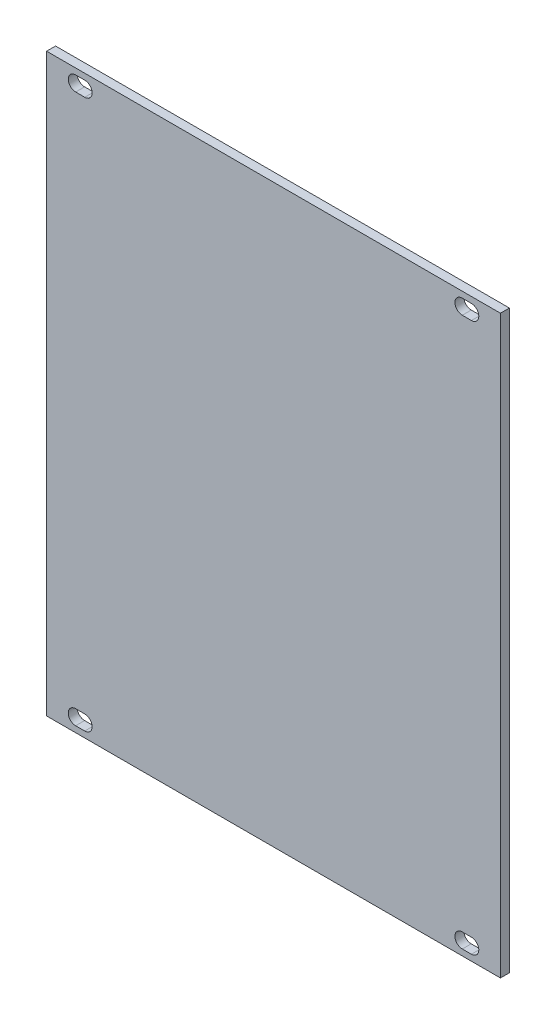
ISO-10303-21;
HEADER;
FILE_DESCRIPTION(('STEP AP214'),'2;1');
FILE_NAME('part.step','',(''),(''),'','','');
FILE_SCHEMA(('AUTOMOTIVE_DESIGN { 1 0 10303 214 1 1 1 1 }'));
ENDSEC;
DATA;
#1=APPLICATION_CONTEXT('core data for automotive mechanical design processes');
#2=APPLICATION_PROTOCOL_DEFINITION('international standard','automotive_design',2000,#1);
#3=PRODUCT_CONTEXT('',#1,'mechanical');
#4=PRODUCT('Part','Part','',(#3));
#5=PRODUCT_RELATED_PRODUCT_CATEGORY('part','',(#4));
#6=PRODUCT_DEFINITION_FORMATION('','',#4);
#7=PRODUCT_DEFINITION_CONTEXT('part definition',#1,'design');
#8=PRODUCT_DEFINITION('design','',#6,#7);
#9=PRODUCT_DEFINITION_SHAPE('','',#8);
#10=(LENGTH_UNIT() NAMED_UNIT(*) SI_UNIT(.MILLI.,.METRE.));
#11=(NAMED_UNIT(*) PLANE_ANGLE_UNIT() SI_UNIT($,.RADIAN.));
#12=(NAMED_UNIT(*) SI_UNIT($,.STERADIAN.) SOLID_ANGLE_UNIT());
#13=UNCERTAINTY_MEASURE_WITH_UNIT(LENGTH_MEASURE(1.E-05),#10,'distance_accuracy_value','');
#14=(GEOMETRIC_REPRESENTATION_CONTEXT(3) GLOBAL_UNCERTAINTY_ASSIGNED_CONTEXT((#13)) GLOBAL_UNIT_ASSIGNED_CONTEXT((#10,
#11,#12)) REPRESENTATION_CONTEXT('',''));
#15=CARTESIAN_POINT('',(0.,0.,0.));
#16=DIRECTION('',(0.,0.,1.));
#17=DIRECTION('',(1.,0.,0.));
#18=AXIS2_PLACEMENT_3D('',#15,#16,#17);
#19=CARTESIAN_POINT('',(0.,0.,2.));
#20=DIRECTION('',(0.,0.,1.));
#21=DIRECTION('',(1.,0.,0.));
#22=AXIS2_PLACEMENT_3D('',#19,#20,#21);
#23=PLANE('',#22);
#24=DIRECTION('',(0.,1.,0.));
#25=VECTOR('',#24,1.);
#26=CARTESIAN_POINT('',(50.65,64.25,2.));
#27=LINE('',#26,#25);
#28=CARTESIAN_POINT('',(50.65,-64.25,2.));
#29=VERTEX_POINT('',#28);
#30=CARTESIAN_POINT('',(50.65,64.25,2.));
#31=VERTEX_POINT('',#30);
#32=EDGE_CURVE('E360',#29,#31,#27,.T.);
#33=ORIENTED_EDGE('',*,*,#32,.T.);
#34=DIRECTION('',(-1.,0.,0.));
#35=VECTOR('',#34,1.);
#36=CARTESIAN_POINT('',(-50.65,64.25,2.));
#37=LINE('',#36,#35);
#38=CARTESIAN_POINT('',(-50.65,64.25,2.));
#39=VERTEX_POINT('',#38);
#40=EDGE_CURVE('E364',#31,#39,#37,.T.);
#41=ORIENTED_EDGE('',*,*,#40,.T.);
#42=DIRECTION('',(0.,-1.,0.));
#43=VECTOR('',#42,1.);
#44=CARTESIAN_POINT('',(-50.65,64.25,2.));
#45=LINE('',#44,#43);
#46=CARTESIAN_POINT('',(-50.65,-64.25,2.));
#47=VERTEX_POINT('',#46);
#48=EDGE_CURVE('E368',#39,#47,#45,.T.);
#49=ORIENTED_EDGE('',*,*,#48,.T.);
#50=DIRECTION('',(1.,0.,0.));
#51=VECTOR('',#50,1.);
#52=CARTESIAN_POINT('',(-50.65,-64.25,2.));
#53=LINE('',#52,#51);
#54=EDGE_CURVE('E371',#47,#29,#53,.T.);
#55=ORIENTED_EDGE('',*,*,#54,.T.);
#56=EDGE_LOOP('',(#33,#41,#49,#55));
#57=FACE_BOUND('',#56,.T.);
#58=DIRECTION('',(1.,0.,0.));
#59=VECTOR('',#58,1.);
#60=CARTESIAN_POINT('',(-44.166,-62.9,2.));
#61=LINE('',#60,#59);
#62=CARTESIAN_POINT('',(-44.166,-62.9,2.));
#63=VERTEX_POINT('',#62);
#64=CARTESIAN_POINT('',(-42.134,-62.9,2.));
#65=VERTEX_POINT('',#64);
#66=EDGE_CURVE('E320',#63,#65,#61,.T.);
#67=ORIENTED_EDGE('',*,*,#66,.F.);
#68=CARTESIAN_POINT('',(-44.166,-61.25,2.));
#69=DIRECTION('',(0.,0.,1.));
#70=DIRECTION('',(1.,0.,0.));
#71=AXIS2_PLACEMENT_3D('',#68,#69,#70);
#72=CIRCLE('',#71,1.65);
#73=CARTESIAN_POINT('',(-44.166,-59.6,2.));
#74=VERTEX_POINT('',#73);
#75=EDGE_CURVE('E317',#74,#63,#72,.T.);
#76=ORIENTED_EDGE('',*,*,#75,.F.);
#77=DIRECTION('',(-1.,0.,0.));
#78=VECTOR('',#77,1.);
#79=CARTESIAN_POINT('',(-44.166,-59.6,2.));
#80=LINE('',#79,#78);
#81=CARTESIAN_POINT('',(-42.134,-59.6,2.));
#82=VERTEX_POINT('',#81);
#83=EDGE_CURVE('E328',#82,#74,#80,.T.);
#84=ORIENTED_EDGE('',*,*,#83,.F.);
#85=CARTESIAN_POINT('',(-42.134,-61.25,2.));
#86=DIRECTION('',(0.,0.,1.));
#87=DIRECTION('',(1.,0.,0.));
#88=AXIS2_PLACEMENT_3D('',#85,#86,#87);
#89=CIRCLE('',#88,1.64999999999999);
#90=EDGE_CURVE('E324',#65,#82,#89,.T.);
#91=ORIENTED_EDGE('',*,*,#90,.F.);
#92=EDGE_LOOP('',(#67,#76,#84,#91));
#93=FACE_BOUND('',#92,.T.);
#94=DIRECTION('',(1.,0.,0.));
#95=VECTOR('',#94,1.);
#96=CARTESIAN_POINT('',(42.134000014,59.6,2.));
#97=LINE('',#96,#95);
#98=CARTESIAN_POINT('',(42.134000014,59.6,2.));
#99=VERTEX_POINT('',#98);
#100=CARTESIAN_POINT('',(44.166000014,59.6,2.));
#101=VERTEX_POINT('',#100);
#102=EDGE_CURVE('E277',#99,#101,#97,.T.);
#103=ORIENTED_EDGE('',*,*,#102,.F.);
#104=CARTESIAN_POINT('',(42.134000014,61.25,2.));
#105=DIRECTION('',(0.,0.,1.));
#106=DIRECTION('',(1.,0.,0.));
#107=AXIS2_PLACEMENT_3D('',#104,#105,#106);
#108=CIRCLE('',#107,1.64999999999999);
#109=CARTESIAN_POINT('',(42.134000014,62.9,2.));
#110=VERTEX_POINT('',#109);
#111=EDGE_CURVE('E274',#110,#99,#108,.T.);
#112=ORIENTED_EDGE('',*,*,#111,.F.);
#113=DIRECTION('',(-1.,0.,0.));
#114=VECTOR('',#113,1.);
#115=CARTESIAN_POINT('',(42.134000014,62.9,2.));
#116=LINE('',#115,#114);
#117=CARTESIAN_POINT('',(44.166000014,62.9,2.));
#118=VERTEX_POINT('',#117);
#119=EDGE_CURVE('E285',#118,#110,#116,.T.);
#120=ORIENTED_EDGE('',*,*,#119,.F.);
#121=CARTESIAN_POINT('',(44.166000014,61.25,2.));
#122=DIRECTION('',(0.,0.,1.));
#123=DIRECTION('',(1.,0.,0.));
#124=AXIS2_PLACEMENT_3D('',#121,#122,#123);
#125=CIRCLE('',#124,1.64999999999999);
#126=EDGE_CURVE('E281',#101,#118,#125,.T.);
#127=ORIENTED_EDGE('',*,*,#126,.F.);
#128=EDGE_LOOP('',(#103,#112,#120,#127));
#129=FACE_BOUND('',#128,.T.);
#130=DIRECTION('',(1.,0.,0.));
#131=VECTOR('',#130,1.);
#132=CARTESIAN_POINT('',(-44.166,59.6,2.));
#133=LINE('',#132,#131);
#134=CARTESIAN_POINT('',(-44.166,59.6,2.));
#135=VERTEX_POINT('',#134);
#136=CARTESIAN_POINT('',(-42.134,59.6,2.));
#137=VERTEX_POINT('',#136);
#138=EDGE_CURVE('E234',#135,#137,#133,.T.);
#139=ORIENTED_EDGE('',*,*,#138,.F.);
#140=CARTESIAN_POINT('',(-44.166,61.25,2.));
#141=DIRECTION('',(0.,0.,1.));
#142=DIRECTION('',(1.,0.,0.));
#143=AXIS2_PLACEMENT_3D('',#140,#141,#142);
#144=CIRCLE('',#143,1.65000000000001);
#145=CARTESIAN_POINT('',(-44.166,62.9,2.));
#146=VERTEX_POINT('',#145);
#147=EDGE_CURVE('E231',#146,#135,#144,.T.);
#148=ORIENTED_EDGE('',*,*,#147,.F.);
#149=DIRECTION('',(-1.,0.,0.));
#150=VECTOR('',#149,1.);
#151=CARTESIAN_POINT('',(-44.166,62.9,2.));
#152=LINE('',#151,#150);
#153=CARTESIAN_POINT('',(-42.134,62.9,2.));
#154=VERTEX_POINT('',#153);
#155=EDGE_CURVE('E242',#154,#146,#152,.T.);
#156=ORIENTED_EDGE('',*,*,#155,.F.);
#157=CARTESIAN_POINT('',(-42.134,61.25,2.));
#158=DIRECTION('',(0.,0.,1.));
#159=DIRECTION('',(1.,0.,0.));
#160=AXIS2_PLACEMENT_3D('',#157,#158,#159);
#161=CIRCLE('',#160,1.65);
#162=EDGE_CURVE('E238',#137,#154,#161,.T.);
#163=ORIENTED_EDGE('',*,*,#162,.F.);
#164=EDGE_LOOP('',(#139,#148,#156,#163));
#165=FACE_BOUND('',#164,.T.);
#166=DIRECTION('',(1.,0.,0.));
#167=VECTOR('',#166,1.);
#168=CARTESIAN_POINT('',(42.134000014,-62.9,2.));
#169=LINE('',#168,#167);
#170=CARTESIAN_POINT('',(42.134000014,-62.9,2.));
#171=VERTEX_POINT('',#170);
#172=CARTESIAN_POINT('',(44.166000014,-62.9,2.));
#173=VERTEX_POINT('',#172);
#174=EDGE_CURVE('E192',#171,#173,#169,.T.);
#175=ORIENTED_EDGE('',*,*,#174,.F.);
#176=CARTESIAN_POINT('',(42.134000014,-61.25,2.));
#177=DIRECTION('',(0.,0.,1.));
#178=DIRECTION('',(1.,0.,0.));
#179=AXIS2_PLACEMENT_3D('',#176,#177,#178);
#180=CIRCLE('',#179,1.65);
#181=CARTESIAN_POINT('',(42.134000014,-59.6,2.));
#182=VERTEX_POINT('',#181);
#183=EDGE_CURVE('E183',#182,#171,#180,.T.);
#184=ORIENTED_EDGE('',*,*,#183,.F.);
#185=DIRECTION('',(-1.,0.,0.));
#186=VECTOR('',#185,1.);
#187=CARTESIAN_POINT('',(42.134000014,-59.6,2.));
#188=LINE('',#187,#186);
#189=CARTESIAN_POINT('',(44.166000014,-59.6,2.));
#190=VERTEX_POINT('',#189);
#191=EDGE_CURVE('E209',#190,#182,#188,.T.);
#192=ORIENTED_EDGE('',*,*,#191,.F.);
#193=CARTESIAN_POINT('',(44.166000014,-61.25,2.));
#194=DIRECTION('',(0.,0.,1.));
#195=DIRECTION('',(1.,0.,0.));
#196=AXIS2_PLACEMENT_3D('',#193,#194,#195);
#197=CIRCLE('',#196,1.65);
#198=EDGE_CURVE('E205',#173,#190,#197,.T.);
#199=ORIENTED_EDGE('',*,*,#198,.F.);
#200=EDGE_LOOP('',(#175,#184,#192,#199));
#201=FACE_BOUND('',#200,.T.);
#202=ADVANCED_FACE('F45',(#57,#93,#129,#165,#201),#23,.T.);
#203=CARTESIAN_POINT('',(0.,0.,0.));
#204=DIRECTION('',(0.,0.,1.));
#205=DIRECTION('',(1.,0.,0.));
#206=AXIS2_PLACEMENT_3D('',#203,#204,#205);
#207=PLANE('',#206);
#208=CARTESIAN_POINT('',(-44.166,61.25,0.));
#209=DIRECTION('',(0.,0.,1.));
#210=DIRECTION('',(1.,0.,0.));
#211=AXIS2_PLACEMENT_3D('',#208,#209,#210);
#212=CIRCLE('',#211,1.65000000000001);
#213=CARTESIAN_POINT('',(-44.166,62.9,0.));
#214=VERTEX_POINT('',#213);
#215=CARTESIAN_POINT('',(-44.166,59.6,0.));
#216=VERTEX_POINT('',#215);
#217=EDGE_CURVE('E201',#214,#216,#212,.T.);
#218=ORIENTED_EDGE('',*,*,#217,.T.);
#219=DIRECTION('',(1.,0.,0.));
#220=VECTOR('',#219,1.);
#221=CARTESIAN_POINT('',(-44.166,59.6,0.));
#222=LINE('',#221,#220);
#223=CARTESIAN_POINT('',(-42.134,59.6,0.));
#224=VERTEX_POINT('',#223);
#225=EDGE_CURVE('E249',#216,#224,#222,.T.);
#226=ORIENTED_EDGE('',*,*,#225,.T.);
#227=CARTESIAN_POINT('',(-42.134,61.25,0.));
#228=DIRECTION('',(0.,0.,1.));
#229=DIRECTION('',(1.,0.,0.));
#230=AXIS2_PLACEMENT_3D('',#227,#228,#229);
#231=CIRCLE('',#230,1.65);
#232=CARTESIAN_POINT('',(-42.134,62.9,0.));
#233=VERTEX_POINT('',#232);
#234=EDGE_CURVE('E253',#224,#233,#231,.T.);
#235=ORIENTED_EDGE('',*,*,#234,.T.);
#236=DIRECTION('',(-1.,0.,0.));
#237=VECTOR('',#236,1.);
#238=CARTESIAN_POINT('',(-44.166,62.9,0.));
#239=LINE('',#238,#237);
#240=EDGE_CURVE('E235',#233,#214,#239,.T.);
#241=ORIENTED_EDGE('',*,*,#240,.T.);
#242=EDGE_LOOP('',(#218,#226,#235,#241));
#243=FACE_BOUND('',#242,.T.);
#244=CARTESIAN_POINT('',(-44.166,-61.25,0.));
#245=DIRECTION('',(0.,0.,1.));
#246=DIRECTION('',(1.,0.,0.));
#247=AXIS2_PLACEMENT_3D('',#244,#245,#246);
#248=CIRCLE('',#247,1.65);
#249=CARTESIAN_POINT('',(-44.166,-59.6,0.));
#250=VERTEX_POINT('',#249);
#251=CARTESIAN_POINT('',(-44.166,-62.9,0.));
#252=VERTEX_POINT('',#251);
#253=EDGE_CURVE('E316',#250,#252,#248,.T.);
#254=ORIENTED_EDGE('',*,*,#253,.T.);
#255=DIRECTION('',(1.,0.,0.));
#256=VECTOR('',#255,1.);
#257=CARTESIAN_POINT('',(-44.166,-62.9,0.));
#258=LINE('',#257,#256);
#259=CARTESIAN_POINT('',(-42.134,-62.9,0.));
#260=VERTEX_POINT('',#259);
#261=EDGE_CURVE('E335',#252,#260,#258,.T.);
#262=ORIENTED_EDGE('',*,*,#261,.T.);
#263=CARTESIAN_POINT('',(-42.134,-61.25,0.));
#264=DIRECTION('',(0.,0.,1.));
#265=DIRECTION('',(1.,0.,0.));
#266=AXIS2_PLACEMENT_3D('',#263,#264,#265);
#267=CIRCLE('',#266,1.64999999999999);
#268=CARTESIAN_POINT('',(-42.134,-59.6,0.));
#269=VERTEX_POINT('',#268);
#270=EDGE_CURVE('E339',#260,#269,#267,.T.);
#271=ORIENTED_EDGE('',*,*,#270,.T.);
#272=DIRECTION('',(-1.,0.,0.));
#273=VECTOR('',#272,1.);
#274=CARTESIAN_POINT('',(-44.166,-59.6,0.));
#275=LINE('',#274,#273);
#276=EDGE_CURVE('E321',#269,#250,#275,.T.);
#277=ORIENTED_EDGE('',*,*,#276,.T.);
#278=EDGE_LOOP('',(#254,#262,#271,#277));
#279=FACE_BOUND('',#278,.T.);
#280=DIRECTION('',(0.,1.,0.));
#281=VECTOR('',#280,1.);
#282=CARTESIAN_POINT('',(50.65,64.25,0.));
#283=LINE('',#282,#281);
#284=CARTESIAN_POINT('',(50.65,-64.25,0.));
#285=VERTEX_POINT('',#284);
#286=CARTESIAN_POINT('',(50.65,64.25,0.));
#287=VERTEX_POINT('',#286);
#288=EDGE_CURVE('E359',#285,#287,#283,.T.);
#289=ORIENTED_EDGE('',*,*,#288,.F.);
#290=DIRECTION('',(1.,0.,0.));
#291=VECTOR('',#290,1.);
#292=CARTESIAN_POINT('',(-50.65,-64.25,0.));
#293=LINE('',#292,#291);
#294=CARTESIAN_POINT('',(-50.65,-64.25,0.));
#295=VERTEX_POINT('',#294);
#296=EDGE_CURVE('E365',#295,#285,#293,.T.);
#297=ORIENTED_EDGE('',*,*,#296,.F.);
#298=DIRECTION('',(0.,-1.,0.));
#299=VECTOR('',#298,1.);
#300=CARTESIAN_POINT('',(-50.65,64.25,0.));
#301=LINE('',#300,#299);
#302=CARTESIAN_POINT('',(-50.65,64.25,0.));
#303=VERTEX_POINT('',#302);
#304=EDGE_CURVE('E381',#303,#295,#301,.T.);
#305=ORIENTED_EDGE('',*,*,#304,.F.);
#306=DIRECTION('',(-1.,0.,0.));
#307=VECTOR('',#306,1.);
#308=CARTESIAN_POINT('',(-50.65,64.25,0.));
#309=LINE('',#308,#307);
#310=EDGE_CURVE('E378',#287,#303,#309,.T.);
#311=ORIENTED_EDGE('',*,*,#310,.F.);
#312=EDGE_LOOP('',(#289,#297,#305,#311));
#313=FACE_BOUND('',#312,.T.);
#314=CARTESIAN_POINT('',(42.134000014,61.25,0.));
#315=DIRECTION('',(0.,0.,1.));
#316=DIRECTION('',(1.,0.,0.));
#317=AXIS2_PLACEMENT_3D('',#314,#315,#316);
#318=CIRCLE('',#317,1.64999999999999);
#319=CARTESIAN_POINT('',(42.134000014,62.9,0.));
#320=VERTEX_POINT('',#319);
#321=CARTESIAN_POINT('',(42.134000014,59.6,0.));
#322=VERTEX_POINT('',#321);
#323=EDGE_CURVE('E273',#320,#322,#318,.T.);
#324=ORIENTED_EDGE('',*,*,#323,.T.);
#325=DIRECTION('',(1.,0.,0.));
#326=VECTOR('',#325,1.);
#327=CARTESIAN_POINT('',(42.134000014,59.6,0.));
#328=LINE('',#327,#326);
#329=CARTESIAN_POINT('',(44.166000014,59.6,0.));
#330=VERTEX_POINT('',#329);
#331=EDGE_CURVE('E292',#322,#330,#328,.T.);
#332=ORIENTED_EDGE('',*,*,#331,.T.);
#333=CARTESIAN_POINT('',(44.166000014,61.25,0.));
#334=DIRECTION('',(0.,0.,1.));
#335=DIRECTION('',(1.,0.,0.));
#336=AXIS2_PLACEMENT_3D('',#333,#334,#335);
#337=CIRCLE('',#336,1.64999999999999);
#338=CARTESIAN_POINT('',(44.166000014,62.9,0.));
#339=VERTEX_POINT('',#338);
#340=EDGE_CURVE('E296',#330,#339,#337,.T.);
#341=ORIENTED_EDGE('',*,*,#340,.T.);
#342=DIRECTION('',(-1.,0.,0.));
#343=VECTOR('',#342,1.);
#344=CARTESIAN_POINT('',(42.134000014,62.9,0.));
#345=LINE('',#344,#343);
#346=EDGE_CURVE('E278',#339,#320,#345,.T.);
#347=ORIENTED_EDGE('',*,*,#346,.T.);
#348=EDGE_LOOP('',(#324,#332,#341,#347));
#349=FACE_BOUND('',#348,.T.);
#350=CARTESIAN_POINT('',(42.134000014,-61.25,0.));
#351=DIRECTION('',(0.,0.,1.));
#352=DIRECTION('',(1.,0.,0.));
#353=AXIS2_PLACEMENT_3D('',#350,#351,#352);
#354=CIRCLE('',#353,1.65);
#355=CARTESIAN_POINT('',(42.134000014,-59.6,0.));
#356=VERTEX_POINT('',#355);
#357=CARTESIAN_POINT('',(42.134000014,-62.9,0.));
#358=VERTEX_POINT('',#357);
#359=EDGE_CURVE('E69',#356,#358,#354,.T.);
#360=ORIENTED_EDGE('',*,*,#359,.T.);
#361=DIRECTION('',(1.,0.,0.));
#362=VECTOR('',#361,1.);
#363=CARTESIAN_POINT('',(42.134000014,-62.9,0.));
#364=LINE('',#363,#362);
#365=CARTESIAN_POINT('',(44.166000014,-62.9,0.));
#366=VERTEX_POINT('',#365);
#367=EDGE_CURVE('E199',#358,#366,#364,.T.);
#368=ORIENTED_EDGE('',*,*,#367,.T.);
#369=CARTESIAN_POINT('',(44.166000014,-61.25,0.));
#370=DIRECTION('',(0.,0.,1.));
#371=DIRECTION('',(1.,0.,0.));
#372=AXIS2_PLACEMENT_3D('',#369,#370,#371);
#373=CIRCLE('',#372,1.65);
#374=CARTESIAN_POINT('',(44.166000014,-59.6,0.));
#375=VERTEX_POINT('',#374);
#376=EDGE_CURVE('E218',#366,#375,#373,.T.);
#377=ORIENTED_EDGE('',*,*,#376,.T.);
#378=DIRECTION('',(-1.,0.,0.));
#379=VECTOR('',#378,1.);
#380=CARTESIAN_POINT('',(42.134000014,-59.6,0.));
#381=LINE('',#380,#379);
#382=EDGE_CURVE('E193',#375,#356,#381,.T.);
#383=ORIENTED_EDGE('',*,*,#382,.T.);
#384=EDGE_LOOP('',(#360,#368,#377,#383));
#385=FACE_BOUND('',#384,.T.);
#386=ADVANCED_FACE('F404',(#243,#279,#313,#349,#385),#207,.F.);
#387=CARTESIAN_POINT('',(50.65,64.25,2.));
#388=DIRECTION('',(-1.,0.,0.));
#389=DIRECTION('',(0.,-1.,0.));
#390=AXIS2_PLACEMENT_3D('',#387,#388,#389);
#391=PLANE('',#390);
#392=ORIENTED_EDGE('',*,*,#288,.T.);
#393=DIRECTION('',(0.,0.,-1.));
#394=VECTOR('',#393,1.);
#395=CARTESIAN_POINT('',(50.65,64.25,2.));
#396=LINE('',#395,#394);
#397=EDGE_CURVE('E11',#31,#287,#396,.T.);
#398=ORIENTED_EDGE('',*,*,#397,.F.);
#399=ORIENTED_EDGE('',*,*,#32,.F.);
#400=DIRECTION('',(0.,0.,-1.));
#401=VECTOR('',#400,1.);
#402=CARTESIAN_POINT('',(50.65,-64.25,2.));
#403=LINE('',#402,#401);
#404=EDGE_CURVE('E374',#29,#285,#403,.T.);
#405=ORIENTED_EDGE('',*,*,#404,.T.);
#406=EDGE_LOOP('',(#392,#398,#399,#405));
#407=FACE_BOUND('',#406,.T.);
#408=ADVANCED_FACE('F47',(#407),#391,.F.);
#409=CARTESIAN_POINT('',(-50.65,64.25,2.));
#410=DIRECTION('',(0.,-1.,0.));
#411=DIRECTION('',(0.,0.,-1.));
#412=AXIS2_PLACEMENT_3D('',#409,#410,#411);
#413=PLANE('',#412);
#414=ORIENTED_EDGE('',*,*,#310,.T.);
#415=DIRECTION('',(0.,0.,-1.));
#416=VECTOR('',#415,1.);
#417=CARTESIAN_POINT('',(-50.65,64.25,2.));
#418=LINE('',#417,#416);
#419=EDGE_CURVE('E54',#39,#303,#418,.T.);
#420=ORIENTED_EDGE('',*,*,#419,.F.);
#421=ORIENTED_EDGE('',*,*,#40,.F.);
#422=ORIENTED_EDGE('',*,*,#397,.T.);
#423=EDGE_LOOP('',(#414,#420,#421,#422));
#424=FACE_BOUND('',#423,.T.);
#425=ADVANCED_FACE('F415',(#424),#413,.F.);
#426=CARTESIAN_POINT('',(-50.65,64.25,2.));
#427=DIRECTION('',(1.,0.,0.));
#428=DIRECTION('',(0.,1.,0.));
#429=AXIS2_PLACEMENT_3D('',#426,#427,#428);
#430=PLANE('',#429);
#431=ORIENTED_EDGE('',*,*,#304,.T.);
#432=DIRECTION('',(0.,0.,-1.));
#433=VECTOR('',#432,1.);
#434=CARTESIAN_POINT('',(-50.65,-64.25,2.));
#435=LINE('',#434,#433);
#436=EDGE_CURVE('E389',#47,#295,#435,.T.);
#437=ORIENTED_EDGE('',*,*,#436,.F.);
#438=ORIENTED_EDGE('',*,*,#48,.F.);
#439=ORIENTED_EDGE('',*,*,#419,.T.);
#440=EDGE_LOOP('',(#431,#437,#438,#439));
#441=FACE_BOUND('',#440,.T.);
#442=ADVANCED_FACE('F398',(#441),#430,.F.);
#443=CARTESIAN_POINT('',(-50.65,-64.25,2.));
#444=DIRECTION('',(0.,1.,0.));
#445=DIRECTION('',(-1.,0.,0.));
#446=AXIS2_PLACEMENT_3D('',#443,#444,#445);
#447=PLANE('',#446);
#448=ORIENTED_EDGE('',*,*,#296,.T.);
#449=ORIENTED_EDGE('',*,*,#404,.F.);
#450=ORIENTED_EDGE('',*,*,#54,.F.);
#451=ORIENTED_EDGE('',*,*,#436,.T.);
#452=EDGE_LOOP('',(#448,#449,#450,#451));
#453=FACE_BOUND('',#452,.T.);
#454=ADVANCED_FACE('F408',(#453),#447,.F.);
#455=CARTESIAN_POINT('',(-44.166,-61.25,2.));
#456=DIRECTION('',(0.,0.,-1.));
#457=DIRECTION('',(-1.,0.,0.));
#458=AXIS2_PLACEMENT_3D('',#455,#456,#457);
#459=CYLINDRICAL_SURFACE('',#458,1.65);
#460=ORIENTED_EDGE('',*,*,#253,.F.);
#461=DIRECTION('',(0.,0.,-1.));
#462=VECTOR('',#461,1.);
#463=CARTESIAN_POINT('',(-44.166,-59.6,2.));
#464=LINE('',#463,#462);
#465=EDGE_CURVE('E331',#74,#250,#464,.T.);
#466=ORIENTED_EDGE('',*,*,#465,.F.);
#467=ORIENTED_EDGE('',*,*,#75,.T.);
#468=DIRECTION('',(0.,0.,-1.));
#469=VECTOR('',#468,1.);
#470=CARTESIAN_POINT('',(-44.166,-62.9,2.));
#471=LINE('',#470,#469);
#472=EDGE_CURVE('E355',#63,#252,#471,.T.);
#473=ORIENTED_EDGE('',*,*,#472,.T.);
#474=EDGE_LOOP('',(#460,#466,#467,#473));
#475=FACE_BOUND('',#474,.T.);
#476=ADVANCED_FACE('F430',(#475),#459,.F.);
#477=CARTESIAN_POINT('',(-44.166,-62.9,2.));
#478=DIRECTION('',(0.,1.,0.));
#479=DIRECTION('',(-1.,0.,0.));
#480=AXIS2_PLACEMENT_3D('',#477,#478,#479);
#481=PLANE('',#480);
#482=ORIENTED_EDGE('',*,*,#261,.F.);
#483=ORIENTED_EDGE('',*,*,#472,.F.);
#484=ORIENTED_EDGE('',*,*,#66,.T.);
#485=DIRECTION('',(0.,0.,-1.));
#486=VECTOR('',#485,1.);
#487=CARTESIAN_POINT('',(-42.134,-62.9,2.));
#488=LINE('',#487,#486);
#489=EDGE_CURVE('E352',#65,#260,#488,.T.);
#490=ORIENTED_EDGE('',*,*,#489,.T.);
#491=EDGE_LOOP('',(#482,#483,#484,#490));
#492=FACE_BOUND('',#491,.T.);
#493=ADVANCED_FACE('F437',(#492),#481,.T.);
#494=CARTESIAN_POINT('',(-42.134,-61.25,2.));
#495=DIRECTION('',(0.,0.,-1.));
#496=DIRECTION('',(-1.,0.,0.));
#497=AXIS2_PLACEMENT_3D('',#494,#495,#496);
#498=CYLINDRICAL_SURFACE('',#497,1.64999999999999);
#499=ORIENTED_EDGE('',*,*,#270,.F.);
#500=ORIENTED_EDGE('',*,*,#489,.F.);
#501=ORIENTED_EDGE('',*,*,#90,.T.);
#502=DIRECTION('',(0.,0.,-1.));
#503=VECTOR('',#502,1.);
#504=CARTESIAN_POINT('',(-42.134,-59.6,2.));
#505=LINE('',#504,#503);
#506=EDGE_CURVE('E349',#82,#269,#505,.T.);
#507=ORIENTED_EDGE('',*,*,#506,.T.);
#508=EDGE_LOOP('',(#499,#500,#501,#507));
#509=FACE_BOUND('',#508,.T.);
#510=ADVANCED_FACE('F442',(#509),#498,.F.);
#511=CARTESIAN_POINT('',(-44.166,-59.6,2.));
#512=DIRECTION('',(0.,-1.,0.));
#513=DIRECTION('',(0.,0.,-1.));
#514=AXIS2_PLACEMENT_3D('',#511,#512,#513);
#515=PLANE('',#514);
#516=ORIENTED_EDGE('',*,*,#276,.F.);
#517=ORIENTED_EDGE('',*,*,#506,.F.);
#518=ORIENTED_EDGE('',*,*,#83,.T.);
#519=ORIENTED_EDGE('',*,*,#465,.T.);
#520=EDGE_LOOP('',(#516,#517,#518,#519));
#521=FACE_BOUND('',#520,.T.);
#522=ADVANCED_FACE('F450',(#521),#515,.T.);
#523=CARTESIAN_POINT('',(42.134000014,61.25,2.));
#524=DIRECTION('',(0.,0.,-1.));
#525=DIRECTION('',(-1.,0.,0.));
#526=AXIS2_PLACEMENT_3D('',#523,#524,#525);
#527=CYLINDRICAL_SURFACE('',#526,1.64999999999999);
#528=ORIENTED_EDGE('',*,*,#323,.F.);
#529=DIRECTION('',(0.,0.,-1.));
#530=VECTOR('',#529,1.);
#531=CARTESIAN_POINT('',(42.134000014,62.9,2.));
#532=LINE('',#531,#530);
#533=EDGE_CURVE('E288',#110,#320,#532,.T.);
#534=ORIENTED_EDGE('',*,*,#533,.F.);
#535=ORIENTED_EDGE('',*,*,#111,.T.);
#536=DIRECTION('',(0.,0.,-1.));
#537=VECTOR('',#536,1.);
#538=CARTESIAN_POINT('',(42.134000014,59.6,2.));
#539=LINE('',#538,#537);
#540=EDGE_CURVE('E312',#99,#322,#539,.T.);
#541=ORIENTED_EDGE('',*,*,#540,.T.);
#542=EDGE_LOOP('',(#528,#534,#535,#541));
#543=FACE_BOUND('',#542,.T.);
#544=ADVANCED_FACE('F504',(#543),#527,.F.);
#545=CARTESIAN_POINT('',(42.134000014,59.6,2.));
#546=DIRECTION('',(0.,1.,0.));
#547=DIRECTION('',(0.,0.,1.));
#548=AXIS2_PLACEMENT_3D('',#545,#546,#547);
#549=PLANE('',#548);
#550=ORIENTED_EDGE('',*,*,#331,.F.);
#551=ORIENTED_EDGE('',*,*,#540,.F.);
#552=ORIENTED_EDGE('',*,*,#102,.T.);
#553=DIRECTION('',(0.,0.,-1.));
#554=VECTOR('',#553,1.);
#555=CARTESIAN_POINT('',(44.166000014,59.6,2.));
#556=LINE('',#555,#554);
#557=EDGE_CURVE('E309',#101,#330,#556,.T.);
#558=ORIENTED_EDGE('',*,*,#557,.T.);
#559=EDGE_LOOP('',(#550,#551,#552,#558));
#560=FACE_BOUND('',#559,.T.);
#561=ADVANCED_FACE('F500',(#560),#549,.T.);
#562=CARTESIAN_POINT('',(44.166000014,61.25,2.));
#563=DIRECTION('',(0.,0.,-1.));
#564=DIRECTION('',(-1.,0.,0.));
#565=AXIS2_PLACEMENT_3D('',#562,#563,#564);
#566=CYLINDRICAL_SURFACE('',#565,1.64999999999999);
#567=ORIENTED_EDGE('',*,*,#340,.F.);
#568=ORIENTED_EDGE('',*,*,#557,.F.);
#569=ORIENTED_EDGE('',*,*,#126,.T.);
#570=DIRECTION('',(0.,0.,-1.));
#571=VECTOR('',#570,1.);
#572=CARTESIAN_POINT('',(44.166000014,62.9,2.));
#573=LINE('',#572,#571);
#574=EDGE_CURVE('E306',#118,#339,#573,.T.);
#575=ORIENTED_EDGE('',*,*,#574,.T.);
#576=EDGE_LOOP('',(#567,#568,#569,#575));
#577=FACE_BOUND('',#576,.T.);
#578=ADVANCED_FACE('F496',(#577),#566,.F.);
#579=CARTESIAN_POINT('',(42.134000014,62.9,2.));
#580=DIRECTION('',(0.,-1.,0.));
#581=DIRECTION('',(0.,0.,-1.));
#582=AXIS2_PLACEMENT_3D('',#579,#580,#581);
#583=PLANE('',#582);
#584=ORIENTED_EDGE('',*,*,#346,.F.);
#585=ORIENTED_EDGE('',*,*,#574,.F.);
#586=ORIENTED_EDGE('',*,*,#119,.T.);
#587=ORIENTED_EDGE('',*,*,#533,.T.);
#588=EDGE_LOOP('',(#584,#585,#586,#587));
#589=FACE_BOUND('',#588,.T.);
#590=ADVANCED_FACE('F493',(#589),#583,.T.);
#591=CARTESIAN_POINT('',(-44.166,61.25,2.));
#592=DIRECTION('',(0.,0.,-1.));
#593=DIRECTION('',(-1.,0.,0.));
#594=AXIS2_PLACEMENT_3D('',#591,#592,#593);
#595=CYLINDRICAL_SURFACE('',#594,1.65000000000001);
#596=ORIENTED_EDGE('',*,*,#217,.F.);
#597=DIRECTION('',(0.,0.,-1.));
#598=VECTOR('',#597,1.);
#599=CARTESIAN_POINT('',(-44.166,62.9,2.));
#600=LINE('',#599,#598);
#601=EDGE_CURVE('E245',#146,#214,#600,.T.);
#602=ORIENTED_EDGE('',*,*,#601,.F.);
#603=ORIENTED_EDGE('',*,*,#147,.T.);
#604=DIRECTION('',(0.,0.,-1.));
#605=VECTOR('',#604,1.);
#606=CARTESIAN_POINT('',(-44.166,59.6,2.));
#607=LINE('',#606,#605);
#608=EDGE_CURVE('E269',#135,#216,#607,.T.);
#609=ORIENTED_EDGE('',*,*,#608,.T.);
#610=EDGE_LOOP('',(#596,#602,#603,#609));
#611=FACE_BOUND('',#610,.T.);
#612=ADVANCED_FACE('F475',(#611),#595,.F.);
#613=CARTESIAN_POINT('',(-44.166,59.6,2.));
#614=DIRECTION('',(0.,1.,0.));
#615=DIRECTION('',(0.,0.,1.));
#616=AXIS2_PLACEMENT_3D('',#613,#614,#615);
#617=PLANE('',#616);
#618=ORIENTED_EDGE('',*,*,#225,.F.);
#619=ORIENTED_EDGE('',*,*,#608,.F.);
#620=ORIENTED_EDGE('',*,*,#138,.T.);
#621=DIRECTION('',(0.,0.,-1.));
#622=VECTOR('',#621,1.);
#623=CARTESIAN_POINT('',(-42.134,59.6,2.));
#624=LINE('',#623,#622);
#625=EDGE_CURVE('E266',#137,#224,#624,.T.);
#626=ORIENTED_EDGE('',*,*,#625,.T.);
#627=EDGE_LOOP('',(#618,#619,#620,#626));
#628=FACE_BOUND('',#627,.T.);
#629=ADVANCED_FACE('F469',(#628),#617,.T.);
#630=CARTESIAN_POINT('',(-42.134,61.25,2.));
#631=DIRECTION('',(0.,0.,-1.));
#632=DIRECTION('',(-1.,0.,0.));
#633=AXIS2_PLACEMENT_3D('',#630,#631,#632);
#634=CYLINDRICAL_SURFACE('',#633,1.65);
#635=ORIENTED_EDGE('',*,*,#234,.F.);
#636=ORIENTED_EDGE('',*,*,#625,.F.);
#637=ORIENTED_EDGE('',*,*,#162,.T.);
#638=DIRECTION('',(0.,0.,-1.));
#639=VECTOR('',#638,1.);
#640=CARTESIAN_POINT('',(-42.134,62.9,2.));
#641=LINE('',#640,#639);
#642=EDGE_CURVE('E263',#154,#233,#641,.T.);
#643=ORIENTED_EDGE('',*,*,#642,.T.);
#644=EDGE_LOOP('',(#635,#636,#637,#643));
#645=FACE_BOUND('',#644,.T.);
#646=ADVANCED_FACE('F472',(#645),#634,.F.);
#647=CARTESIAN_POINT('',(-44.166,62.9,2.));
#648=DIRECTION('',(0.,-1.,0.));
#649=DIRECTION('',(1.,0.,0.));
#650=AXIS2_PLACEMENT_3D('',#647,#648,#649);
#651=PLANE('',#650);
#652=ORIENTED_EDGE('',*,*,#240,.F.);
#653=ORIENTED_EDGE('',*,*,#642,.F.);
#654=ORIENTED_EDGE('',*,*,#155,.T.);
#655=ORIENTED_EDGE('',*,*,#601,.T.);
#656=EDGE_LOOP('',(#652,#653,#654,#655));
#657=FACE_BOUND('',#656,.T.);
#658=ADVANCED_FACE('F478',(#657),#651,.T.);
#659=CARTESIAN_POINT('',(42.134000014,-61.25,2.));
#660=DIRECTION('',(0.,0.,-1.));
#661=DIRECTION('',(-1.,0.,0.));
#662=AXIS2_PLACEMENT_3D('',#659,#660,#661);
#663=CYLINDRICAL_SURFACE('',#662,1.65);
#664=ORIENTED_EDGE('',*,*,#359,.F.);
#665=DIRECTION('',(0.,0.,-1.));
#666=VECTOR('',#665,1.);
#667=CARTESIAN_POINT('',(42.134000014,-59.6,2.));
#668=LINE('',#667,#666);
#669=EDGE_CURVE('E187',#182,#356,#668,.T.);
#670=ORIENTED_EDGE('',*,*,#669,.F.);
#671=ORIENTED_EDGE('',*,*,#183,.T.);
#672=DIRECTION('',(0.,0.,-1.));
#673=VECTOR('',#672,1.);
#674=CARTESIAN_POINT('',(42.134000014,-62.9,2.));
#675=LINE('',#674,#673);
#676=EDGE_CURVE('E186',#171,#358,#675,.T.);
#677=ORIENTED_EDGE('',*,*,#676,.T.);
#678=EDGE_LOOP('',(#664,#670,#671,#677));
#679=FACE_BOUND('',#678,.T.);
#680=ADVANCED_FACE('F185',(#679),#663,.F.);
#681=CARTESIAN_POINT('',(42.134000014,-62.9,2.));
#682=DIRECTION('',(0.,1.,0.));
#683=DIRECTION('',(0.,0.,1.));
#684=AXIS2_PLACEMENT_3D('',#681,#682,#683);
#685=PLANE('',#684);
#686=ORIENTED_EDGE('',*,*,#367,.F.);
#687=ORIENTED_EDGE('',*,*,#676,.F.);
#688=ORIENTED_EDGE('',*,*,#174,.T.);
#689=DIRECTION('',(0.,0.,-1.));
#690=VECTOR('',#689,1.);
#691=CARTESIAN_POINT('',(44.166000014,-62.9,2.));
#692=LINE('',#691,#690);
#693=EDGE_CURVE('E202',#173,#366,#692,.T.);
#694=ORIENTED_EDGE('',*,*,#693,.T.);
#695=EDGE_LOOP('',(#686,#687,#688,#694));
#696=FACE_BOUND('',#695,.T.);
#697=ADVANCED_FACE('F196',(#696),#685,.T.);
#698=CARTESIAN_POINT('',(44.166000014,-61.25,2.));
#699=DIRECTION('',(0.,0.,-1.));
#700=DIRECTION('',(-1.,0.,0.));
#701=AXIS2_PLACEMENT_3D('',#698,#699,#700);
#702=CYLINDRICAL_SURFACE('',#701,1.65);
#703=ORIENTED_EDGE('',*,*,#376,.F.);
#704=ORIENTED_EDGE('',*,*,#693,.F.);
#705=ORIENTED_EDGE('',*,*,#198,.T.);
#706=DIRECTION('',(0.,0.,-1.));
#707=VECTOR('',#706,1.);
#708=CARTESIAN_POINT('',(44.166000014,-59.6,2.));
#709=LINE('',#708,#707);
#710=EDGE_CURVE('E61',#190,#375,#709,.T.);
#711=ORIENTED_EDGE('',*,*,#710,.T.);
#712=EDGE_LOOP('',(#703,#704,#705,#711));
#713=FACE_BOUND('',#712,.T.);
#714=ADVANCED_FACE('F576',(#713),#702,.F.);
#715=CARTESIAN_POINT('',(42.134000014,-59.6,2.));
#716=DIRECTION('',(0.,-1.,0.));
#717=DIRECTION('',(0.,0.,-1.));
#718=AXIS2_PLACEMENT_3D('',#715,#716,#717);
#719=PLANE('',#718);
#720=ORIENTED_EDGE('',*,*,#382,.F.);
#721=ORIENTED_EDGE('',*,*,#710,.F.);
#722=ORIENTED_EDGE('',*,*,#191,.T.);
#723=ORIENTED_EDGE('',*,*,#669,.T.);
#724=EDGE_LOOP('',(#720,#721,#722,#723));
#725=FACE_BOUND('',#724,.T.);
#726=ADVANCED_FACE('F584',(#725),#719,.T.);
#727=CLOSED_SHELL('',(#202,#386,#408,#425,#442,#454,#476,#493,#510,#522,#544,#561,#578,#590,
#612,#629,#646,#658,#680,#697,#714,#726));
#728=MANIFOLD_SOLID_BREP('B2',#727);
#729=ADVANCED_BREP_SHAPE_REPRESENTATION('',(#18,#728),#14);
#730=SHAPE_DEFINITION_REPRESENTATION(#9,#729);
ENDSEC;
END-ISO-10303-21;
